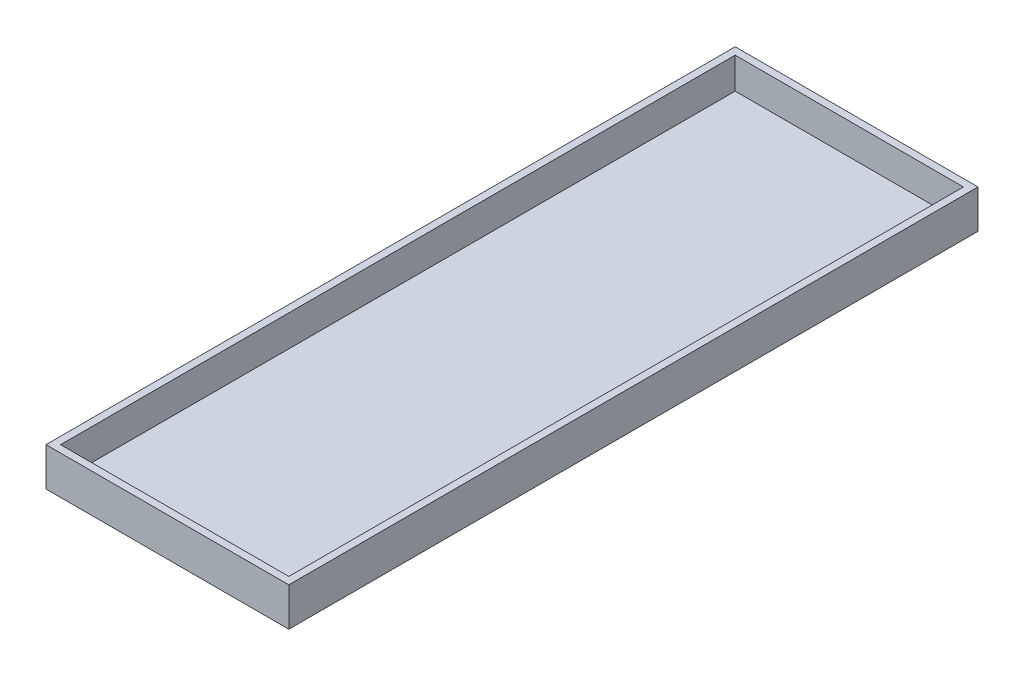
ISO-10303-21;
HEADER;
FILE_DESCRIPTION(('STEP AP214'),'2;1');
FILE_NAME('part.step','',(''),(''),'','','');
FILE_SCHEMA(('AUTOMOTIVE_DESIGN { 1 0 10303 214 1 1 1 1 }'));
ENDSEC;
DATA;
#1=APPLICATION_CONTEXT('core data for automotive mechanical design processes');
#2=APPLICATION_PROTOCOL_DEFINITION('international standard','automotive_design',2000,#1);
#3=PRODUCT_CONTEXT('',#1,'mechanical');
#4=PRODUCT('Part','Part','',(#3));
#5=PRODUCT_RELATED_PRODUCT_CATEGORY('part','',(#4));
#6=PRODUCT_DEFINITION_FORMATION('','',#4);
#7=PRODUCT_DEFINITION_CONTEXT('part definition',#1,'design');
#8=PRODUCT_DEFINITION('design','',#6,#7);
#9=PRODUCT_DEFINITION_SHAPE('','',#8);
#10=(LENGTH_UNIT() NAMED_UNIT(*) SI_UNIT(.MILLI.,.METRE.));
#11=(NAMED_UNIT(*) PLANE_ANGLE_UNIT() SI_UNIT($,.RADIAN.));
#12=(NAMED_UNIT(*) SI_UNIT($,.STERADIAN.) SOLID_ANGLE_UNIT());
#13=UNCERTAINTY_MEASURE_WITH_UNIT(LENGTH_MEASURE(1.E-05),#10,'distance_accuracy_value','');
#14=(GEOMETRIC_REPRESENTATION_CONTEXT(3) GLOBAL_UNCERTAINTY_ASSIGNED_CONTEXT((#13)) GLOBAL_UNIT_ASSIGNED_CONTEXT((#10,
#11,#12)) REPRESENTATION_CONTEXT('',''));
#15=CARTESIAN_POINT('',(0.,0.,0.));
#16=DIRECTION('',(0.,0.,1.));
#17=DIRECTION('',(1.,0.,0.));
#18=AXIS2_PLACEMENT_3D('',#15,#16,#17);
#19=CARTESIAN_POINT('',(0.,9.5,0.));
#20=DIRECTION('',(0.,1.,0.));
#21=DIRECTION('',(0.,0.,1.));
#22=AXIS2_PLACEMENT_3D('',#19,#20,#21);
#23=PLANE('',#22);
#24=DIRECTION('',(1.,0.,0.));
#25=VECTOR('',#24,1.);
#26=CARTESIAN_POINT('',(0.,9.5,-170.3));
#27=LINE('',#26,#25);
#28=CARTESIAN_POINT('',(0.,9.5,-170.3));
#29=VERTEX_POINT('',#28);
#30=CARTESIAN_POINT('',(60.,9.5,-170.3));
#31=VERTEX_POINT('',#30);
#32=EDGE_CURVE('E168',#29,#31,#27,.T.);
#33=ORIENTED_EDGE('',*,*,#32,.F.);
#34=DIRECTION('',(0.,0.,-1.));
#35=VECTOR('',#34,1.);
#36=CARTESIAN_POINT('',(0.,9.5,0.));
#37=LINE('',#36,#35);
#38=CARTESIAN_POINT('',(0.,9.5,0.));
#39=VERTEX_POINT('',#38);
#40=EDGE_CURVE('E177',#39,#29,#37,.T.);
#41=ORIENTED_EDGE('',*,*,#40,.F.);
#42=DIRECTION('',(1.,0.,0.));
#43=VECTOR('',#42,1.);
#44=CARTESIAN_POINT('',(0.,9.5,0.));
#45=LINE('',#44,#43);
#46=CARTESIAN_POINT('',(60.,9.5,0.));
#47=VERTEX_POINT('',#46);
#48=EDGE_CURVE('E174',#39,#47,#45,.T.);
#49=ORIENTED_EDGE('',*,*,#48,.T.);
#50=DIRECTION('',(0.,0.,-1.));
#51=VECTOR('',#50,1.);
#52=CARTESIAN_POINT('',(60.,9.5,0.));
#53=LINE('',#52,#51);
#54=EDGE_CURVE('E94',#47,#31,#53,.T.);
#55=ORIENTED_EDGE('',*,*,#54,.T.);
#56=EDGE_LOOP('',(#33,#41,#49,#55));
#57=FACE_BOUND('',#56,.T.);
#58=DIRECTION('',(0.,0.,-1.));
#59=VECTOR('',#58,1.);
#60=CARTESIAN_POINT('',(1.8,9.5,0.));
#61=LINE('',#60,#59);
#62=CARTESIAN_POINT('',(1.8,9.5,-1.8));
#63=VERTEX_POINT('',#62);
#64=CARTESIAN_POINT('',(1.8,9.5,-168.5));
#65=VERTEX_POINT('',#64);
#66=EDGE_CURVE('E160',#63,#65,#61,.T.);
#67=ORIENTED_EDGE('',*,*,#66,.T.);
#68=DIRECTION('',(1.,0.,0.));
#69=VECTOR('',#68,1.);
#70=CARTESIAN_POINT('',(0.,9.5,-168.5));
#71=LINE('',#70,#69);
#72=CARTESIAN_POINT('',(58.2,9.5,-168.5));
#73=VERTEX_POINT('',#72);
#74=EDGE_CURVE('E124',#65,#73,#71,.T.);
#75=ORIENTED_EDGE('',*,*,#74,.T.);
#76=DIRECTION('',(0.,0.,-1.));
#77=VECTOR('',#76,1.);
#78=CARTESIAN_POINT('',(58.2,9.5,0.));
#79=LINE('',#78,#77);
#80=CARTESIAN_POINT('',(58.2,9.5,-1.8));
#81=VERTEX_POINT('',#80);
#82=EDGE_CURVE('E148',#81,#73,#79,.T.);
#83=ORIENTED_EDGE('',*,*,#82,.F.);
#84=DIRECTION('',(1.,0.,0.));
#85=VECTOR('',#84,1.);
#86=CARTESIAN_POINT('',(0.,9.5,-1.8));
#87=LINE('',#86,#85);
#88=EDGE_CURVE('E163',#63,#81,#87,.T.);
#89=ORIENTED_EDGE('',*,*,#88,.F.);
#90=EDGE_LOOP('',(#67,#75,#83,#89));
#91=FACE_BOUND('',#90,.T.);
#92=ADVANCED_FACE('F43',(#57,#91),#23,.T.);
#93=CARTESIAN_POINT('',(0.,9.5,-170.3));
#94=DIRECTION('',(0.,0.,-1.));
#95=DIRECTION('',(-1.,0.,0.));
#96=AXIS2_PLACEMENT_3D('',#93,#94,#95);
#97=PLANE('',#96);
#98=DIRECTION('',(1.,0.,0.));
#99=VECTOR('',#98,1.);
#100=CARTESIAN_POINT('',(0.,0.,-170.3));
#101=LINE('',#100,#99);
#102=CARTESIAN_POINT('',(0.,0.,-170.3));
#103=VERTEX_POINT('',#102);
#104=CARTESIAN_POINT('',(60.,0.,-170.3));
#105=VERTEX_POINT('',#104);
#106=EDGE_CURVE('E130',#103,#105,#101,.T.);
#107=ORIENTED_EDGE('',*,*,#106,.F.);
#108=DIRECTION('',(0.,-1.,0.));
#109=VECTOR('',#108,1.);
#110=CARTESIAN_POINT('',(0.,9.5,-170.3));
#111=LINE('',#110,#109);
#112=EDGE_CURVE('E11',#29,#103,#111,.T.);
#113=ORIENTED_EDGE('',*,*,#112,.F.);
#114=ORIENTED_EDGE('',*,*,#32,.T.);
#115=DIRECTION('',(0.,-1.,0.));
#116=VECTOR('',#115,1.);
#117=CARTESIAN_POINT('',(60.,9.5,-170.3));
#118=LINE('',#117,#116);
#119=EDGE_CURVE('E47',#31,#105,#118,.T.);
#120=ORIENTED_EDGE('',*,*,#119,.T.);
#121=EDGE_LOOP('',(#107,#113,#114,#120));
#122=FACE_BOUND('',#121,.T.);
#123=ADVANCED_FACE('F45',(#122),#97,.T.);
#124=CARTESIAN_POINT('',(0.,9.5,0.));
#125=DIRECTION('',(-1.,0.,0.));
#126=DIRECTION('',(0.,0.,1.));
#127=AXIS2_PLACEMENT_3D('',#124,#125,#126);
#128=PLANE('',#127);
#129=DIRECTION('',(0.,0.,-1.));
#130=VECTOR('',#129,1.);
#131=CARTESIAN_POINT('',(0.,0.,0.));
#132=LINE('',#131,#130);
#133=CARTESIAN_POINT('',(0.,0.,0.));
#134=VERTEX_POINT('',#133);
#135=EDGE_CURVE('E171',#134,#103,#132,.T.);
#136=ORIENTED_EDGE('',*,*,#135,.F.);
#137=DIRECTION('',(0.,-1.,0.));
#138=VECTOR('',#137,1.);
#139=CARTESIAN_POINT('',(0.,9.5,0.));
#140=LINE('',#139,#138);
#141=EDGE_CURVE('E53',#39,#134,#140,.T.);
#142=ORIENTED_EDGE('',*,*,#141,.F.);
#143=ORIENTED_EDGE('',*,*,#40,.T.);
#144=ORIENTED_EDGE('',*,*,#112,.T.);
#145=EDGE_LOOP('',(#136,#142,#143,#144));
#146=FACE_BOUND('',#145,.T.);
#147=ADVANCED_FACE('F205',(#146),#128,.T.);
#148=CARTESIAN_POINT('',(0.,9.5,0.));
#149=DIRECTION('',(0.,0.,-1.));
#150=DIRECTION('',(-1.,0.,0.));
#151=AXIS2_PLACEMENT_3D('',#148,#149,#150);
#152=PLANE('',#151);
#153=DIRECTION('',(1.,0.,0.));
#154=VECTOR('',#153,1.);
#155=CARTESIAN_POINT('',(0.,0.,0.));
#156=LINE('',#155,#154);
#157=CARTESIAN_POINT('',(60.,0.,0.));
#158=VERTEX_POINT('',#157);
#159=EDGE_CURVE('E187',#134,#158,#156,.T.);
#160=ORIENTED_EDGE('',*,*,#159,.T.);
#161=DIRECTION('',(0.,-1.,0.));
#162=VECTOR('',#161,1.);
#163=CARTESIAN_POINT('',(60.,9.5,0.));
#164=LINE('',#163,#162);
#165=EDGE_CURVE('E194',#47,#158,#164,.T.);
#166=ORIENTED_EDGE('',*,*,#165,.F.);
#167=ORIENTED_EDGE('',*,*,#48,.F.);
#168=ORIENTED_EDGE('',*,*,#141,.T.);
#169=EDGE_LOOP('',(#160,#166,#167,#168));
#170=FACE_BOUND('',#169,.T.);
#171=ADVANCED_FACE('F209',(#170),#152,.F.);
#172=CARTESIAN_POINT('',(60.,9.5,0.));
#173=DIRECTION('',(-1.,0.,0.));
#174=DIRECTION('',(0.,0.,1.));
#175=AXIS2_PLACEMENT_3D('',#172,#173,#174);
#176=PLANE('',#175);
#177=DIRECTION('',(0.,0.,-1.));
#178=VECTOR('',#177,1.);
#179=CARTESIAN_POINT('',(60.,0.,0.));
#180=LINE('',#179,#178);
#181=EDGE_CURVE('E183',#158,#105,#180,.T.);
#182=ORIENTED_EDGE('',*,*,#181,.T.);
#183=ORIENTED_EDGE('',*,*,#119,.F.);
#184=ORIENTED_EDGE('',*,*,#54,.F.);
#185=ORIENTED_EDGE('',*,*,#165,.T.);
#186=EDGE_LOOP('',(#182,#183,#184,#185));
#187=FACE_BOUND('',#186,.T.);
#188=ADVANCED_FACE('F201',(#187),#176,.F.);
#189=CARTESIAN_POINT('',(0.,0.,0.));
#190=DIRECTION('',(0.,1.,0.));
#191=DIRECTION('',(0.,0.,1.));
#192=AXIS2_PLACEMENT_3D('',#189,#190,#191);
#193=PLANE('',#192);
#194=ORIENTED_EDGE('',*,*,#106,.T.);
#195=ORIENTED_EDGE('',*,*,#181,.F.);
#196=ORIENTED_EDGE('',*,*,#159,.F.);
#197=ORIENTED_EDGE('',*,*,#135,.T.);
#198=EDGE_LOOP('',(#194,#195,#196,#197));
#199=FACE_BOUND('',#198,.T.);
#200=ADVANCED_FACE('F204',(#199),#193,.F.);
#201=CARTESIAN_POINT('',(0.,9.5,-168.5));
#202=DIRECTION('',(0.,0.,-1.));
#203=DIRECTION('',(-1.,0.,0.));
#204=AXIS2_PLACEMENT_3D('',#201,#202,#203);
#205=PLANE('',#204);
#206=DIRECTION('',(1.,0.,0.));
#207=VECTOR('',#206,1.);
#208=CARTESIAN_POINT('',(0.,1.8,-168.5));
#209=LINE('',#208,#207);
#210=CARTESIAN_POINT('',(1.8,1.8,-168.5));
#211=VERTEX_POINT('',#210);
#212=CARTESIAN_POINT('',(58.2,1.8,-168.5));
#213=VERTEX_POINT('',#212);
#214=EDGE_CURVE('E122',#211,#213,#209,.T.);
#215=ORIENTED_EDGE('',*,*,#214,.T.);
#216=DIRECTION('',(0.,-1.,0.));
#217=VECTOR('',#216,1.);
#218=CARTESIAN_POINT('',(58.2,9.5,-168.5));
#219=LINE('',#218,#217);
#220=EDGE_CURVE('E153',#73,#213,#219,.T.);
#221=ORIENTED_EDGE('',*,*,#220,.F.);
#222=ORIENTED_EDGE('',*,*,#74,.F.);
#223=DIRECTION('',(0.,-1.,0.));
#224=VECTOR('',#223,1.);
#225=CARTESIAN_POINT('',(1.8,9.5,-168.5));
#226=LINE('',#225,#224);
#227=EDGE_CURVE('E118',#65,#211,#226,.T.);
#228=ORIENTED_EDGE('',*,*,#227,.T.);
#229=EDGE_LOOP('',(#215,#221,#222,#228));
#230=FACE_BOUND('',#229,.T.);
#231=ADVANCED_FACE('F120',(#230),#205,.F.);
#232=CARTESIAN_POINT('',(1.8,9.5,0.));
#233=DIRECTION('',(-1.,0.,0.));
#234=DIRECTION('',(0.,0.,1.));
#235=AXIS2_PLACEMENT_3D('',#232,#233,#234);
#236=PLANE('',#235);
#237=DIRECTION('',(0.,0.,-1.));
#238=VECTOR('',#237,1.);
#239=CARTESIAN_POINT('',(1.8,1.8,0.));
#240=LINE('',#239,#238);
#241=CARTESIAN_POINT('',(1.8,1.8,-1.8));
#242=VERTEX_POINT('',#241);
#243=EDGE_CURVE('E137',#242,#211,#240,.T.);
#244=ORIENTED_EDGE('',*,*,#243,.T.);
#245=ORIENTED_EDGE('',*,*,#227,.F.);
#246=ORIENTED_EDGE('',*,*,#66,.F.);
#247=DIRECTION('',(0.,-1.,0.));
#248=VECTOR('',#247,1.);
#249=CARTESIAN_POINT('',(1.8,9.5,-1.8));
#250=LINE('',#249,#248);
#251=EDGE_CURVE('E131',#63,#242,#250,.T.);
#252=ORIENTED_EDGE('',*,*,#251,.T.);
#253=EDGE_LOOP('',(#244,#245,#246,#252));
#254=FACE_BOUND('',#253,.T.);
#255=ADVANCED_FACE('F141',(#254),#236,.F.);
#256=CARTESIAN_POINT('',(0.,9.5,-1.8));
#257=DIRECTION('',(0.,0.,-1.));
#258=DIRECTION('',(-1.,0.,0.));
#259=AXIS2_PLACEMENT_3D('',#256,#257,#258);
#260=PLANE('',#259);
#261=DIRECTION('',(1.,0.,0.));
#262=VECTOR('',#261,1.);
#263=CARTESIAN_POINT('',(0.,1.8,-1.8));
#264=LINE('',#263,#262);
#265=CARTESIAN_POINT('',(58.2,1.8,-1.8));
#266=VERTEX_POINT('',#265);
#267=EDGE_CURVE('E144',#242,#266,#264,.T.);
#268=ORIENTED_EDGE('',*,*,#267,.F.);
#269=ORIENTED_EDGE('',*,*,#251,.F.);
#270=ORIENTED_EDGE('',*,*,#88,.T.);
#271=DIRECTION('',(0.,-1.,0.));
#272=VECTOR('',#271,1.);
#273=CARTESIAN_POINT('',(58.2,9.5,-1.8));
#274=LINE('',#273,#272);
#275=EDGE_CURVE('E61',#81,#266,#274,.T.);
#276=ORIENTED_EDGE('',*,*,#275,.T.);
#277=EDGE_LOOP('',(#268,#269,#270,#276));
#278=FACE_BOUND('',#277,.T.);
#279=ADVANCED_FACE('F216',(#278),#260,.T.);
#280=CARTESIAN_POINT('',(58.2,9.5,0.));
#281=DIRECTION('',(-1.,0.,0.));
#282=DIRECTION('',(0.,0.,1.));
#283=AXIS2_PLACEMENT_3D('',#280,#281,#282);
#284=PLANE('',#283);
#285=DIRECTION('',(0.,0.,-1.));
#286=VECTOR('',#285,1.);
#287=CARTESIAN_POINT('',(58.2,1.8,0.));
#288=LINE('',#287,#286);
#289=EDGE_CURVE('E138',#266,#213,#288,.T.);
#290=ORIENTED_EDGE('',*,*,#289,.F.);
#291=ORIENTED_EDGE('',*,*,#275,.F.);
#292=ORIENTED_EDGE('',*,*,#82,.T.);
#293=ORIENTED_EDGE('',*,*,#220,.T.);
#294=EDGE_LOOP('',(#290,#291,#292,#293));
#295=FACE_BOUND('',#294,.T.);
#296=ADVANCED_FACE('F217',(#295),#284,.T.);
#297=CARTESIAN_POINT('',(0.,1.8,0.));
#298=DIRECTION('',(0.,1.,0.));
#299=DIRECTION('',(0.,0.,1.));
#300=AXIS2_PLACEMENT_3D('',#297,#298,#299);
#301=PLANE('',#300);
#302=ORIENTED_EDGE('',*,*,#214,.F.);
#303=ORIENTED_EDGE('',*,*,#243,.F.);
#304=ORIENTED_EDGE('',*,*,#267,.T.);
#305=ORIENTED_EDGE('',*,*,#289,.T.);
#306=EDGE_LOOP('',(#302,#303,#304,#305));
#307=FACE_BOUND('',#306,.T.);
#308=ADVANCED_FACE('F136',(#307),#301,.T.);
#309=CLOSED_SHELL('',(#92,#123,#147,#171,#188,#200,#231,#255,#279,#296,#308));
#310=MANIFOLD_SOLID_BREP('B2',#309);
#311=ADVANCED_BREP_SHAPE_REPRESENTATION('',(#18,#310),#14);
#312=SHAPE_DEFINITION_REPRESENTATION(#9,#311);
ENDSEC;
END-ISO-10303-21;
